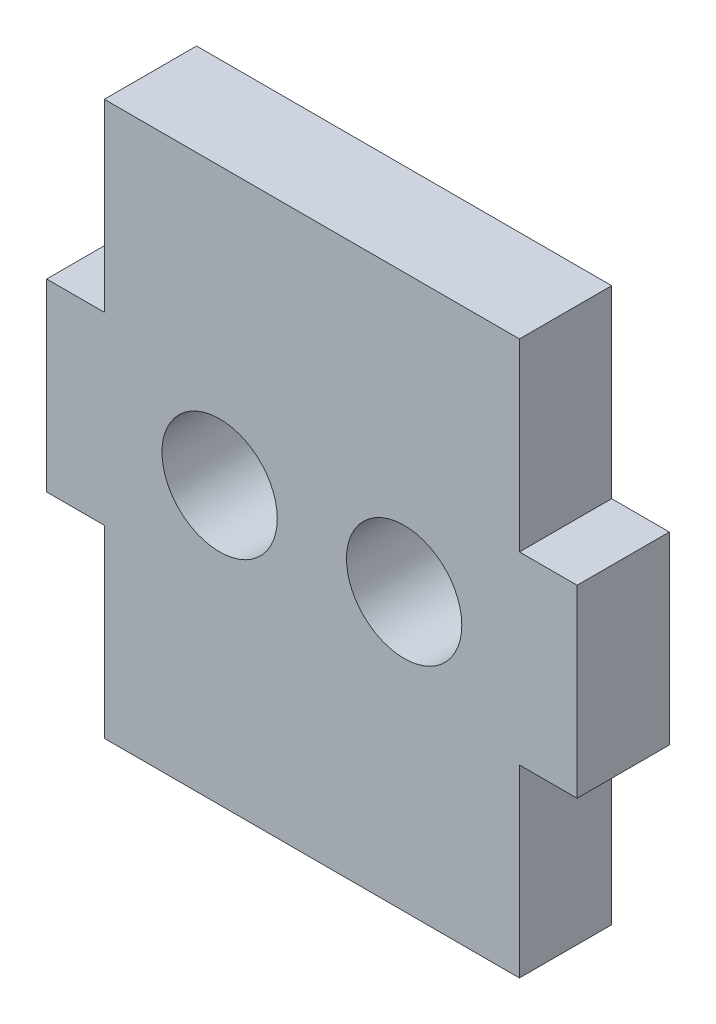
ISO-10303-21;
HEADER;
FILE_DESCRIPTION(('STEP AP214'),'2;1');
FILE_NAME('part.step','',(''),(''),'','','');
FILE_SCHEMA(('AUTOMOTIVE_DESIGN { 1 0 10303 214 1 1 1 1 }'));
ENDSEC;
DATA;
#1=APPLICATION_CONTEXT('core data for automotive mechanical design processes');
#2=APPLICATION_PROTOCOL_DEFINITION('international standard','automotive_design',2000,#1);
#3=PRODUCT_CONTEXT('',#1,'mechanical');
#4=PRODUCT('Part','Part','',(#3));
#5=PRODUCT_RELATED_PRODUCT_CATEGORY('part','',(#4));
#6=PRODUCT_DEFINITION_FORMATION('','',#4);
#7=PRODUCT_DEFINITION_CONTEXT('part definition',#1,'design');
#8=PRODUCT_DEFINITION('design','',#6,#7);
#9=PRODUCT_DEFINITION_SHAPE('','',#8);
#10=(LENGTH_UNIT() NAMED_UNIT(*) SI_UNIT(.MILLI.,.METRE.));
#11=(NAMED_UNIT(*) PLANE_ANGLE_UNIT() SI_UNIT($,.RADIAN.));
#12=(NAMED_UNIT(*) SI_UNIT($,.STERADIAN.) SOLID_ANGLE_UNIT());
#13=UNCERTAINTY_MEASURE_WITH_UNIT(LENGTH_MEASURE(1.E-05),#10,'distance_accuracy_value','');
#14=(GEOMETRIC_REPRESENTATION_CONTEXT(3) GLOBAL_UNCERTAINTY_ASSIGNED_CONTEXT((#13)) GLOBAL_UNIT_ASSIGNED_CONTEXT((#10,
#11,#12)) REPRESENTATION_CONTEXT('',''));
#15=CARTESIAN_POINT('',(0.,0.,0.));
#16=DIRECTION('',(0.,0.,1.));
#17=DIRECTION('',(1.,0.,0.));
#18=AXIS2_PLACEMENT_3D('',#15,#16,#17);
#19=CARTESIAN_POINT('',(0.,0.,2.));
#20=DIRECTION('',(0.,0.,1.));
#21=DIRECTION('',(1.,0.,0.));
#22=AXIS2_PLACEMENT_3D('',#19,#20,#21);
#23=PLANE('',#22);
#24=CARTESIAN_POINT('',(7.75071999999997,6.00000000000023,2.));
#25=DIRECTION('',(0.,0.,1.));
#26=DIRECTION('',(1.,0.,0.));
#27=AXIS2_PLACEMENT_3D('',#24,#25,#26);
#28=CIRCLE('',#27,1.24999999999998);
#29=CARTESIAN_POINT('',(9.00071999999995,6.00000000000023,2.));
#30=VERTEX_POINT('',#29);
#31=EDGE_CURVE('E158',#30,#30,#28,.T.);
#32=ORIENTED_EDGE('',*,*,#31,.F.);
#33=EDGE_LOOP('',(#32));
#34=FACE_BOUND('',#33,.T.);
#35=DIRECTION('',(0.,-1.,0.));
#36=VECTOR('',#35,1.);
#37=CARTESIAN_POINT('',(1.24999999999997,4.,2.));
#38=LINE('',#37,#36);
#39=CARTESIAN_POINT('',(1.24999999999997,4.,2.));
#40=VERTEX_POINT('',#39);
#41=CARTESIAN_POINT('',(1.24999999999997,0.,2.));
#42=VERTEX_POINT('',#41);
#43=EDGE_CURVE('E177',#40,#42,#38,.T.);
#44=ORIENTED_EDGE('',*,*,#43,.T.);
#45=DIRECTION('',(1.,0.,0.));
#46=VECTOR('',#45,1.);
#47=CARTESIAN_POINT('',(1.24999999999997,0.,2.));
#48=LINE('',#47,#46);
#49=CARTESIAN_POINT('',(10.25072,0.,2.));
#50=VERTEX_POINT('',#49);
#51=EDGE_CURVE('E105',#42,#50,#48,.T.);
#52=ORIENTED_EDGE('',*,*,#51,.T.);
#53=DIRECTION('',(0.,1.,0.));
#54=VECTOR('',#53,1.);
#55=CARTESIAN_POINT('',(10.25072,4.,2.));
#56=LINE('',#55,#54);
#57=CARTESIAN_POINT('',(10.25072,4.,2.));
#58=VERTEX_POINT('',#57);
#59=EDGE_CURVE('E204',#50,#58,#56,.T.);
#60=ORIENTED_EDGE('',*,*,#59,.T.);
#61=DIRECTION('',(1.,0.,0.));
#62=VECTOR('',#61,1.);
#63=CARTESIAN_POINT('',(10.25072,4.,2.));
#64=LINE('',#63,#62);
#65=CARTESIAN_POINT('',(11.5007199999999,4.,2.));
#66=VERTEX_POINT('',#65);
#67=EDGE_CURVE('E223',#58,#66,#64,.T.);
#68=ORIENTED_EDGE('',*,*,#67,.T.);
#69=DIRECTION('',(0.,1.,0.));
#70=VECTOR('',#69,1.);
#71=CARTESIAN_POINT('',(11.5007199999999,8.00000000000001,2.));
#72=LINE('',#71,#70);
#73=CARTESIAN_POINT('',(11.5007199999999,8.00000000000001,2.));
#74=VERTEX_POINT('',#73);
#75=EDGE_CURVE('E220',#66,#74,#72,.T.);
#76=ORIENTED_EDGE('',*,*,#75,.T.);
#77=DIRECTION('',(-1.,0.,0.));
#78=VECTOR('',#77,1.);
#79=CARTESIAN_POINT('',(10.25072,8.00000000000001,2.));
#80=LINE('',#79,#78);
#81=CARTESIAN_POINT('',(10.25072,8.00000000000001,2.));
#82=VERTEX_POINT('',#81);
#83=EDGE_CURVE('E222',#74,#82,#80,.T.);
#84=ORIENTED_EDGE('',*,*,#83,.T.);
#85=DIRECTION('',(0.,1.,0.));
#86=VECTOR('',#85,1.);
#87=CARTESIAN_POINT('',(10.25072,8.00000000000001,2.));
#88=LINE('',#87,#86);
#89=CARTESIAN_POINT('',(10.25072,12.,2.));
#90=VERTEX_POINT('',#89);
#91=EDGE_CURVE('E225',#82,#90,#88,.T.);
#92=ORIENTED_EDGE('',*,*,#91,.T.);
#93=DIRECTION('',(-1.,0.,0.));
#94=VECTOR('',#93,1.);
#95=CARTESIAN_POINT('',(10.25072,12.,2.));
#96=LINE('',#95,#94);
#97=CARTESIAN_POINT('',(1.24999999999997,12.,2.));
#98=VERTEX_POINT('',#97);
#99=EDGE_CURVE('E231',#90,#98,#96,.T.);
#100=ORIENTED_EDGE('',*,*,#99,.T.);
#101=DIRECTION('',(0.,-1.,0.));
#102=VECTOR('',#101,1.);
#103=CARTESIAN_POINT('',(1.24999999999997,8.00000000000001,2.));
#104=LINE('',#103,#102);
#105=CARTESIAN_POINT('',(1.24999999999997,8.00000000000001,2.));
#106=VERTEX_POINT('',#105);
#107=EDGE_CURVE('E136',#98,#106,#104,.T.);
#108=ORIENTED_EDGE('',*,*,#107,.T.);
#109=DIRECTION('',(-1.,0.,0.));
#110=VECTOR('',#109,1.);
#111=CARTESIAN_POINT('',(1.24999999999997,8.00000000000001,2.));
#112=LINE('',#111,#110);
#113=CARTESIAN_POINT('',(0.,8.00000000000001,2.));
#114=VERTEX_POINT('',#113);
#115=EDGE_CURVE('E130',#106,#114,#112,.T.);
#116=ORIENTED_EDGE('',*,*,#115,.T.);
#117=DIRECTION('',(0.,-1.,0.));
#118=VECTOR('',#117,1.);
#119=CARTESIAN_POINT('',(0.,8.00000000000001,2.));
#120=LINE('',#119,#118);
#121=CARTESIAN_POINT('',(0.,4.,2.));
#122=VERTEX_POINT('',#121);
#123=EDGE_CURVE('E134',#114,#122,#120,.T.);
#124=ORIENTED_EDGE('',*,*,#123,.T.);
#125=DIRECTION('',(1.,0.,0.));
#126=VECTOR('',#125,1.);
#127=CARTESIAN_POINT('',(1.24999999999997,4.,2.));
#128=LINE('',#127,#126);
#129=EDGE_CURVE('E50',#122,#40,#128,.T.);
#130=ORIENTED_EDGE('',*,*,#129,.T.);
#131=EDGE_LOOP('',(#44,#52,#60,#68,#76,#84,#92,#100,#108,#116,#124,#130));
#132=FACE_BOUND('',#131,.T.);
#133=CARTESIAN_POINT('',(3.74999999999997,6.00000000000023,2.));
#134=DIRECTION('',(0.,0.,1.));
#135=DIRECTION('',(1.,0.,0.));
#136=AXIS2_PLACEMENT_3D('',#133,#134,#135);
#137=CIRCLE('',#136,1.24999999999997);
#138=CARTESIAN_POINT('',(4.99999999999994,6.00000000000023,2.));
#139=VERTEX_POINT('',#138);
#140=EDGE_CURVE('E274',#139,#139,#137,.T.);
#141=ORIENTED_EDGE('',*,*,#140,.F.);
#142=EDGE_LOOP('',(#141));
#143=FACE_BOUND('',#142,.T.);
#144=ADVANCED_FACE('F33',(#34,#132,#143),#23,.T.);
#145=CARTESIAN_POINT('',(0.,0.,0.));
#146=DIRECTION('',(0.,0.,1.));
#147=DIRECTION('',(1.,0.,0.));
#148=AXIS2_PLACEMENT_3D('',#145,#146,#147);
#149=PLANE('',#148);
#150=CARTESIAN_POINT('',(7.75071999999997,6.00000000000023,0.));
#151=DIRECTION('',(0.,0.,1.));
#152=DIRECTION('',(1.,0.,0.));
#153=AXIS2_PLACEMENT_3D('',#150,#151,#152);
#154=CIRCLE('',#153,1.24999999999998);
#155=CARTESIAN_POINT('',(9.00071999999995,6.00000000000023,0.));
#156=VERTEX_POINT('',#155);
#157=EDGE_CURVE('E279',#156,#156,#154,.T.);
#158=ORIENTED_EDGE('',*,*,#157,.T.);
#159=EDGE_LOOP('',(#158));
#160=FACE_BOUND('',#159,.T.);
#161=DIRECTION('',(0.,-1.,0.));
#162=VECTOR('',#161,1.);
#163=CARTESIAN_POINT('',(1.24999999999997,4.,0.));
#164=LINE('',#163,#162);
#165=CARTESIAN_POINT('',(1.24999999999997,4.,0.));
#166=VERTEX_POINT('',#165);
#167=CARTESIAN_POINT('',(1.24999999999997,0.,0.));
#168=VERTEX_POINT('',#167);
#169=EDGE_CURVE('E154',#166,#168,#164,.T.);
#170=ORIENTED_EDGE('',*,*,#169,.F.);
#171=DIRECTION('',(1.,0.,0.));
#172=VECTOR('',#171,1.);
#173=CARTESIAN_POINT('',(1.24999999999997,4.,0.));
#174=LINE('',#173,#172);
#175=CARTESIAN_POINT('',(0.,4.,0.));
#176=VERTEX_POINT('',#175);
#177=EDGE_CURVE('E97',#176,#166,#174,.T.);
#178=ORIENTED_EDGE('',*,*,#177,.F.);
#179=DIRECTION('',(0.,-1.,0.));
#180=VECTOR('',#179,1.);
#181=CARTESIAN_POINT('',(0.,8.00000000000001,0.));
#182=LINE('',#181,#180);
#183=CARTESIAN_POINT('',(0.,8.00000000000001,0.));
#184=VERTEX_POINT('',#183);
#185=EDGE_CURVE('E91',#184,#176,#182,.T.);
#186=ORIENTED_EDGE('',*,*,#185,.F.);
#187=DIRECTION('',(-1.,0.,0.));
#188=VECTOR('',#187,1.);
#189=CARTESIAN_POINT('',(1.24999999999997,8.00000000000001,0.));
#190=LINE('',#189,#188);
#191=CARTESIAN_POINT('',(1.24999999999997,8.00000000000001,0.));
#192=VERTEX_POINT('',#191);
#193=EDGE_CURVE('E144',#192,#184,#190,.T.);
#194=ORIENTED_EDGE('',*,*,#193,.F.);
#195=DIRECTION('',(0.,-1.,0.));
#196=VECTOR('',#195,1.);
#197=CARTESIAN_POINT('',(1.24999999999997,8.00000000000001,0.));
#198=LINE('',#197,#196);
#199=CARTESIAN_POINT('',(1.24999999999997,12.,0.));
#200=VERTEX_POINT('',#199);
#201=EDGE_CURVE('E172',#200,#192,#198,.T.);
#202=ORIENTED_EDGE('',*,*,#201,.F.);
#203=DIRECTION('',(-1.,0.,0.));
#204=VECTOR('',#203,1.);
#205=CARTESIAN_POINT('',(10.25072,12.,0.));
#206=LINE('',#205,#204);
#207=CARTESIAN_POINT('',(10.25072,12.,0.));
#208=VERTEX_POINT('',#207);
#209=EDGE_CURVE('E170',#208,#200,#206,.T.);
#210=ORIENTED_EDGE('',*,*,#209,.F.);
#211=DIRECTION('',(0.,1.,0.));
#212=VECTOR('',#211,1.);
#213=CARTESIAN_POINT('',(10.25072,8.00000000000001,0.));
#214=LINE('',#213,#212);
#215=CARTESIAN_POINT('',(10.25072,8.00000000000001,0.));
#216=VERTEX_POINT('',#215);
#217=EDGE_CURVE('E168',#216,#208,#214,.T.);
#218=ORIENTED_EDGE('',*,*,#217,.F.);
#219=DIRECTION('',(-1.,0.,0.));
#220=VECTOR('',#219,1.);
#221=CARTESIAN_POINT('',(10.25072,8.00000000000001,0.));
#222=LINE('',#221,#220);
#223=CARTESIAN_POINT('',(11.5007199999999,8.00000000000001,0.));
#224=VERTEX_POINT('',#223);
#225=EDGE_CURVE('E166',#224,#216,#222,.T.);
#226=ORIENTED_EDGE('',*,*,#225,.F.);
#227=DIRECTION('',(0.,1.,0.));
#228=VECTOR('',#227,1.);
#229=CARTESIAN_POINT('',(11.5007199999999,8.00000000000001,0.));
#230=LINE('',#229,#228);
#231=CARTESIAN_POINT('',(11.5007199999999,4.,0.));
#232=VERTEX_POINT('',#231);
#233=EDGE_CURVE('E164',#232,#224,#230,.T.);
#234=ORIENTED_EDGE('',*,*,#233,.F.);
#235=DIRECTION('',(1.,0.,0.));
#236=VECTOR('',#235,1.);
#237=CARTESIAN_POINT('',(10.25072,4.,0.));
#238=LINE('',#237,#236);
#239=CARTESIAN_POINT('',(10.25072,4.,0.));
#240=VERTEX_POINT('',#239);
#241=EDGE_CURVE('E162',#240,#232,#238,.T.);
#242=ORIENTED_EDGE('',*,*,#241,.F.);
#243=DIRECTION('',(0.,1.,0.));
#244=VECTOR('',#243,1.);
#245=CARTESIAN_POINT('',(10.25072,4.,0.));
#246=LINE('',#245,#244);
#247=CARTESIAN_POINT('',(10.25072,0.,0.));
#248=VERTEX_POINT('',#247);
#249=EDGE_CURVE('E160',#248,#240,#246,.T.);
#250=ORIENTED_EDGE('',*,*,#249,.F.);
#251=DIRECTION('',(1.,0.,0.));
#252=VECTOR('',#251,1.);
#253=CARTESIAN_POINT('',(1.24999999999997,0.,0.));
#254=LINE('',#253,#252);
#255=EDGE_CURVE('E157',#168,#248,#254,.T.);
#256=ORIENTED_EDGE('',*,*,#255,.F.);
#257=EDGE_LOOP('',(#170,#178,#186,#194,#202,#210,#218,#226,#234,#242,#250,#256));
#258=FACE_BOUND('',#257,.T.);
#259=CARTESIAN_POINT('',(3.74999999999997,6.00000000000023,0.));
#260=DIRECTION('',(0.,0.,1.));
#261=DIRECTION('',(1.,0.,0.));
#262=AXIS2_PLACEMENT_3D('',#259,#260,#261);
#263=CIRCLE('',#262,1.24999999999997);
#264=CARTESIAN_POINT('',(4.99999999999994,6.00000000000023,0.));
#265=VERTEX_POINT('',#264);
#266=EDGE_CURVE('E277',#265,#265,#263,.T.);
#267=ORIENTED_EDGE('',*,*,#266,.T.);
#268=EDGE_LOOP('',(#267));
#269=FACE_BOUND('',#268,.T.);
#270=ADVANCED_FACE('F208',(#160,#258,#269),#149,.F.);
#271=CARTESIAN_POINT('',(1.24999999999997,4.,2.));
#272=DIRECTION('',(1.,0.,0.));
#273=DIRECTION('',(0.,1.,0.));
#274=AXIS2_PLACEMENT_3D('',#271,#272,#273);
#275=PLANE('',#274);
#276=ORIENTED_EDGE('',*,*,#169,.T.);
#277=DIRECTION('',(0.,0.,-1.));
#278=VECTOR('',#277,1.);
#279=CARTESIAN_POINT('',(1.24999999999997,0.,2.));
#280=LINE('',#279,#278);
#281=EDGE_CURVE('E11',#42,#168,#280,.T.);
#282=ORIENTED_EDGE('',*,*,#281,.F.);
#283=ORIENTED_EDGE('',*,*,#43,.F.);
#284=DIRECTION('',(0.,0.,-1.));
#285=VECTOR('',#284,1.);
#286=CARTESIAN_POINT('',(1.24999999999997,4.,2.));
#287=LINE('',#286,#285);
#288=EDGE_CURVE('E150',#40,#166,#287,.T.);
#289=ORIENTED_EDGE('',*,*,#288,.T.);
#290=EDGE_LOOP('',(#276,#282,#283,#289));
#291=FACE_BOUND('',#290,.T.);
#292=ADVANCED_FACE('F35',(#291),#275,.F.);
#293=CARTESIAN_POINT('',(1.24999999999997,0.,2.));
#294=DIRECTION('',(0.,1.,0.));
#295=DIRECTION('',(-1.,0.,0.));
#296=AXIS2_PLACEMENT_3D('',#293,#294,#295);
#297=PLANE('',#296);
#298=ORIENTED_EDGE('',*,*,#255,.T.);
#299=DIRECTION('',(0.,0.,-1.));
#300=VECTOR('',#299,1.);
#301=CARTESIAN_POINT('',(10.25072,0.,2.));
#302=LINE('',#301,#300);
#303=EDGE_CURVE('E42',#50,#248,#302,.T.);
#304=ORIENTED_EDGE('',*,*,#303,.F.);
#305=ORIENTED_EDGE('',*,*,#51,.F.);
#306=ORIENTED_EDGE('',*,*,#281,.T.);
#307=EDGE_LOOP('',(#298,#304,#305,#306));
#308=FACE_BOUND('',#307,.T.);
#309=ADVANCED_FACE('F372',(#308),#297,.F.);
#310=CARTESIAN_POINT('',(10.25072,4.,2.));
#311=DIRECTION('',(-1.,0.,0.));
#312=DIRECTION('',(0.,-1.,0.));
#313=AXIS2_PLACEMENT_3D('',#310,#311,#312);
#314=PLANE('',#313);
#315=ORIENTED_EDGE('',*,*,#249,.T.);
#316=DIRECTION('',(0.,0.,-1.));
#317=VECTOR('',#316,1.);
#318=CARTESIAN_POINT('',(10.25072,4.,2.));
#319=LINE('',#318,#317);
#320=EDGE_CURVE('E196',#58,#240,#319,.T.);
#321=ORIENTED_EDGE('',*,*,#320,.F.);
#322=ORIENTED_EDGE('',*,*,#59,.F.);
#323=ORIENTED_EDGE('',*,*,#303,.T.);
#324=EDGE_LOOP('',(#315,#321,#322,#323));
#325=FACE_BOUND('',#324,.T.);
#326=ADVANCED_FACE('F202',(#325),#314,.F.);
#327=CARTESIAN_POINT('',(10.25072,4.,2.));
#328=DIRECTION('',(0.,1.,0.));
#329=DIRECTION('',(0.,0.,1.));
#330=AXIS2_PLACEMENT_3D('',#327,#328,#329);
#331=PLANE('',#330);
#332=ORIENTED_EDGE('',*,*,#241,.T.);
#333=DIRECTION('',(0.,0.,-1.));
#334=VECTOR('',#333,1.);
#335=CARTESIAN_POINT('',(11.5007199999999,4.,2.));
#336=LINE('',#335,#334);
#337=EDGE_CURVE('E193',#66,#232,#336,.T.);
#338=ORIENTED_EDGE('',*,*,#337,.F.);
#339=ORIENTED_EDGE('',*,*,#67,.F.);
#340=ORIENTED_EDGE('',*,*,#320,.T.);
#341=EDGE_LOOP('',(#332,#338,#339,#340));
#342=FACE_BOUND('',#341,.T.);
#343=ADVANCED_FACE('F214',(#342),#331,.F.);
#344=CARTESIAN_POINT('',(11.5007199999999,8.00000000000001,2.));
#345=DIRECTION('',(-1.,0.,0.));
#346=DIRECTION('',(0.,0.,1.));
#347=AXIS2_PLACEMENT_3D('',#344,#345,#346);
#348=PLANE('',#347);
#349=ORIENTED_EDGE('',*,*,#233,.T.);
#350=DIRECTION('',(0.,0.,-1.));
#351=VECTOR('',#350,1.);
#352=CARTESIAN_POINT('',(11.5007199999999,8.00000000000001,2.));
#353=LINE('',#352,#351);
#354=EDGE_CURVE('E190',#74,#224,#353,.T.);
#355=ORIENTED_EDGE('',*,*,#354,.F.);
#356=ORIENTED_EDGE('',*,*,#75,.F.);
#357=ORIENTED_EDGE('',*,*,#337,.T.);
#358=EDGE_LOOP('',(#349,#355,#356,#357));
#359=FACE_BOUND('',#358,.T.);
#360=ADVANCED_FACE('F218',(#359),#348,.F.);
#361=CARTESIAN_POINT('',(10.25072,8.00000000000001,2.));
#362=DIRECTION('',(0.,-1.,0.));
#363=DIRECTION('',(0.,0.,-1.));
#364=AXIS2_PLACEMENT_3D('',#361,#362,#363);
#365=PLANE('',#364);
#366=ORIENTED_EDGE('',*,*,#225,.T.);
#367=DIRECTION('',(0.,0.,-1.));
#368=VECTOR('',#367,1.);
#369=CARTESIAN_POINT('',(10.25072,8.00000000000001,2.));
#370=LINE('',#369,#368);
#371=EDGE_CURVE('E187',#82,#216,#370,.T.);
#372=ORIENTED_EDGE('',*,*,#371,.F.);
#373=ORIENTED_EDGE('',*,*,#83,.F.);
#374=ORIENTED_EDGE('',*,*,#354,.T.);
#375=EDGE_LOOP('',(#366,#372,#373,#374));
#376=FACE_BOUND('',#375,.T.);
#377=ADVANCED_FACE('F337',(#376),#365,.F.);
#378=CARTESIAN_POINT('',(10.25072,8.00000000000001,2.));
#379=DIRECTION('',(-1.,0.,0.));
#380=DIRECTION('',(0.,-1.,0.));
#381=AXIS2_PLACEMENT_3D('',#378,#379,#380);
#382=PLANE('',#381);
#383=ORIENTED_EDGE('',*,*,#217,.T.);
#384=DIRECTION('',(0.,0.,-1.));
#385=VECTOR('',#384,1.);
#386=CARTESIAN_POINT('',(10.25072,12.,2.));
#387=LINE('',#386,#385);
#388=EDGE_CURVE('E184',#90,#208,#387,.T.);
#389=ORIENTED_EDGE('',*,*,#388,.F.);
#390=ORIENTED_EDGE('',*,*,#91,.F.);
#391=ORIENTED_EDGE('',*,*,#371,.T.);
#392=EDGE_LOOP('',(#383,#389,#390,#391));
#393=FACE_BOUND('',#392,.T.);
#394=ADVANCED_FACE('F328',(#393),#382,.F.);
#395=CARTESIAN_POINT('',(10.25072,12.,2.));
#396=DIRECTION('',(0.,-1.,0.));
#397=DIRECTION('',(1.,0.,0.));
#398=AXIS2_PLACEMENT_3D('',#395,#396,#397);
#399=PLANE('',#398);
#400=ORIENTED_EDGE('',*,*,#209,.T.);
#401=DIRECTION('',(0.,0.,-1.));
#402=VECTOR('',#401,1.);
#403=CARTESIAN_POINT('',(1.24999999999997,12.,2.));
#404=LINE('',#403,#402);
#405=EDGE_CURVE('E181',#98,#200,#404,.T.);
#406=ORIENTED_EDGE('',*,*,#405,.F.);
#407=ORIENTED_EDGE('',*,*,#99,.F.);
#408=ORIENTED_EDGE('',*,*,#388,.T.);
#409=EDGE_LOOP('',(#400,#406,#407,#408));
#410=FACE_BOUND('',#409,.T.);
#411=ADVANCED_FACE('F237',(#410),#399,.F.);
#412=CARTESIAN_POINT('',(1.24999999999997,8.00000000000001,2.));
#413=DIRECTION('',(1.,0.,0.));
#414=DIRECTION('',(0.,1.,0.));
#415=AXIS2_PLACEMENT_3D('',#412,#413,#414);
#416=PLANE('',#415);
#417=ORIENTED_EDGE('',*,*,#201,.T.);
#418=DIRECTION('',(0.,0.,-1.));
#419=VECTOR('',#418,1.);
#420=CARTESIAN_POINT('',(1.24999999999997,8.00000000000001,2.));
#421=LINE('',#420,#419);
#422=EDGE_CURVE('E145',#106,#192,#421,.T.);
#423=ORIENTED_EDGE('',*,*,#422,.F.);
#424=ORIENTED_EDGE('',*,*,#107,.F.);
#425=ORIENTED_EDGE('',*,*,#405,.T.);
#426=EDGE_LOOP('',(#417,#423,#424,#425));
#427=FACE_BOUND('',#426,.T.);
#428=ADVANCED_FACE('F241',(#427),#416,.F.);
#429=CARTESIAN_POINT('',(1.24999999999997,8.00000000000001,2.));
#430=DIRECTION('',(0.,-1.,0.));
#431=DIRECTION('',(0.,0.,-1.));
#432=AXIS2_PLACEMENT_3D('',#429,#430,#431);
#433=PLANE('',#432);
#434=ORIENTED_EDGE('',*,*,#193,.T.);
#435=DIRECTION('',(0.,0.,-1.));
#436=VECTOR('',#435,1.);
#437=CARTESIAN_POINT('',(0.,8.00000000000001,2.));
#438=LINE('',#437,#436);
#439=EDGE_CURVE('E141',#114,#184,#438,.T.);
#440=ORIENTED_EDGE('',*,*,#439,.F.);
#441=ORIENTED_EDGE('',*,*,#115,.F.);
#442=ORIENTED_EDGE('',*,*,#422,.T.);
#443=EDGE_LOOP('',(#434,#440,#441,#442));
#444=FACE_BOUND('',#443,.T.);
#445=ADVANCED_FACE('F142',(#444),#433,.F.);
#446=CARTESIAN_POINT('',(0.,8.00000000000001,2.));
#447=DIRECTION('',(1.,0.,0.));
#448=DIRECTION('',(0.,1.,0.));
#449=AXIS2_PLACEMENT_3D('',#446,#447,#448);
#450=PLANE('',#449);
#451=ORIENTED_EDGE('',*,*,#185,.T.);
#452=DIRECTION('',(0.,0.,-1.));
#453=VECTOR('',#452,1.);
#454=CARTESIAN_POINT('',(0.,4.,2.));
#455=LINE('',#454,#453);
#456=EDGE_CURVE('E146',#122,#176,#455,.T.);
#457=ORIENTED_EDGE('',*,*,#456,.F.);
#458=ORIENTED_EDGE('',*,*,#123,.F.);
#459=ORIENTED_EDGE('',*,*,#439,.T.);
#460=EDGE_LOOP('',(#451,#457,#458,#459));
#461=FACE_BOUND('',#460,.T.);
#462=ADVANCED_FACE('F148',(#461),#450,.F.);
#463=CARTESIAN_POINT('',(1.24999999999997,4.,2.));
#464=DIRECTION('',(0.,1.,0.));
#465=DIRECTION('',(0.,0.,1.));
#466=AXIS2_PLACEMENT_3D('',#463,#464,#465);
#467=PLANE('',#466);
#468=ORIENTED_EDGE('',*,*,#177,.T.);
#469=ORIENTED_EDGE('',*,*,#288,.F.);
#470=ORIENTED_EDGE('',*,*,#129,.F.);
#471=ORIENTED_EDGE('',*,*,#456,.T.);
#472=EDGE_LOOP('',(#468,#469,#470,#471));
#473=FACE_BOUND('',#472,.T.);
#474=ADVANCED_FACE('F245',(#473),#467,.F.);
#475=CARTESIAN_POINT('',(7.75071999999997,6.00000000000023,2.));
#476=DIRECTION('',(0.,0.,-1.));
#477=DIRECTION('',(-1.,0.,0.));
#478=AXIS2_PLACEMENT_3D('',#475,#476,#477);
#479=CYLINDRICAL_SURFACE('',#478,1.24999999999998);
#480=ORIENTED_EDGE('',*,*,#31,.T.);
#481=EDGE_LOOP('',(#480));
#482=FACE_BOUND('',#481,.T.);
#483=ORIENTED_EDGE('',*,*,#157,.F.);
#484=EDGE_LOOP('',(#483));
#485=FACE_BOUND('',#484,.T.);
#486=ADVANCED_FACE('F247',(#482,#485),#479,.F.);
#487=CARTESIAN_POINT('',(3.74999999999997,6.00000000000023,2.));
#488=DIRECTION('',(0.,0.,-1.));
#489=DIRECTION('',(-1.,0.,0.));
#490=AXIS2_PLACEMENT_3D('',#487,#488,#489);
#491=CYLINDRICAL_SURFACE('',#490,1.24999999999997);
#492=ORIENTED_EDGE('',*,*,#140,.T.);
#493=EDGE_LOOP('',(#492));
#494=FACE_BOUND('',#493,.T.);
#495=ORIENTED_EDGE('',*,*,#266,.F.);
#496=EDGE_LOOP('',(#495));
#497=FACE_BOUND('',#496,.T.);
#498=ADVANCED_FACE('F253',(#494,#497),#491,.F.);
#499=CLOSED_SHELL('',(#144,#270,#292,#309,#326,#343,#360,#377,#394,#411,#428,#445,#462,#474,
#486,#498));
#500=MANIFOLD_SOLID_BREP('B2',#499);
#501=ADVANCED_BREP_SHAPE_REPRESENTATION('',(#18,#500),#14);
#502=SHAPE_DEFINITION_REPRESENTATION(#9,#501);
ENDSEC;
END-ISO-10303-21;
